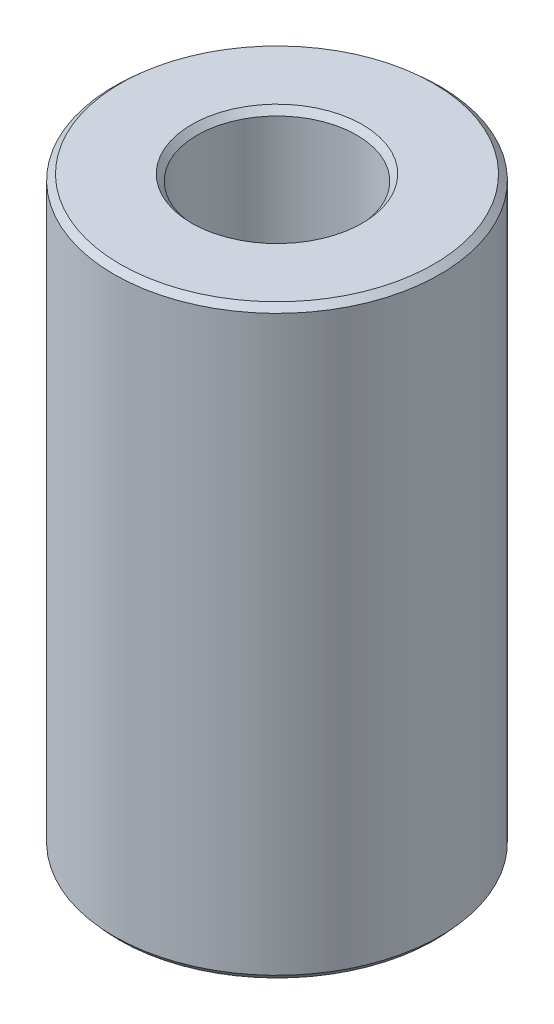
ISO-10303-21;
HEADER;
FILE_DESCRIPTION(('STEP AP214'),'2;1');
FILE_NAME('part.step','',(''),(''),'','','');
FILE_SCHEMA(('AUTOMOTIVE_DESIGN { 1 0 10303 214 1 1 1 1 }'));
ENDSEC;
DATA;
#1=APPLICATION_CONTEXT('core data for automotive mechanical design processes');
#2=APPLICATION_PROTOCOL_DEFINITION('international standard','automotive_design',2000,#1);
#3=PRODUCT_CONTEXT('',#1,'mechanical');
#4=PRODUCT('Part','Part','',(#3));
#5=PRODUCT_RELATED_PRODUCT_CATEGORY('part','',(#4));
#6=PRODUCT_DEFINITION_FORMATION('','',#4);
#7=PRODUCT_DEFINITION_CONTEXT('part definition',#1,'design');
#8=PRODUCT_DEFINITION('design','',#6,#7);
#9=PRODUCT_DEFINITION_SHAPE('','',#8);
#10=(LENGTH_UNIT() NAMED_UNIT(*) SI_UNIT(.MILLI.,.METRE.));
#11=(NAMED_UNIT(*) PLANE_ANGLE_UNIT() SI_UNIT($,.RADIAN.));
#12=(NAMED_UNIT(*) SI_UNIT($,.STERADIAN.) SOLID_ANGLE_UNIT());
#13=UNCERTAINTY_MEASURE_WITH_UNIT(LENGTH_MEASURE(1.E-05),#10,'distance_accuracy_value','');
#14=(GEOMETRIC_REPRESENTATION_CONTEXT(3) GLOBAL_UNCERTAINTY_ASSIGNED_CONTEXT((#13)) GLOBAL_UNIT_ASSIGNED_CONTEXT((#10,
#11,#12)) REPRESENTATION_CONTEXT('',''));
#15=CARTESIAN_POINT('',(0.,0.,0.));
#16=DIRECTION('',(0.,0.,1.));
#17=DIRECTION('',(1.,0.,0.));
#18=AXIS2_PLACEMENT_3D('',#15,#16,#17);
#19=CARTESIAN_POINT('',(0.,170.591020044849,0.));
#20=DIRECTION('',(0.,-1.,0.));
#21=DIRECTION('',(0.,0.,-1.));
#22=AXIS2_PLACEMENT_3D('',#19,#20,#21);
#23=CYLINDRICAL_SURFACE('',#22,47.5);
#24=CARTESIAN_POINT('',(0.,1.83181145555436,0.));
#25=DIRECTION('',(0.,1.,0.));
#26=DIRECTION('',(0.,0.,1.));
#27=AXIS2_PLACEMENT_3D('',#24,#25,#26);
#28=CIRCLE('',#27,47.5);
#29=CARTESIAN_POINT('',(0.,1.83181145555436,-47.5));
#30=VERTEX_POINT('',#29);
#31=EDGE_CURVE('E10',#30,#30,#28,.T.);
#32=CARTESIAN_POINT('',(0.,168.95492158824,0.));
#33=DIRECTION('',(0.,1.,0.));
#34=DIRECTION('',(0.,0.,1.));
#35=AXIS2_PLACEMENT_3D('',#32,#33,#34);
#36=CIRCLE('',#35,47.5);
#37=CARTESIAN_POINT('',(0.,168.95492158824,-47.5));
#38=VERTEX_POINT('',#37);
#39=EDGE_CURVE('E50',#38,#38,#36,.F.);
#40=CARTESIAN_POINT('',(0.,1.83181145555436,-47.5));
#41=CARTESIAN_POINT('',(0.,3.57267718610317,-47.5));
#42=CARTESIAN_POINT('',(0.,5.31354291665197,-47.5));
#43=CARTESIAN_POINT('',(0.,8.79527437774959,-47.5));
#44=CARTESIAN_POINT('',(0.,10.5361401082984,-47.5));
#45=CARTESIAN_POINT('',(0.,14.017871569396,-47.5));
#46=CARTESIAN_POINT('',(0.,15.7587372999448,-47.5));
#47=CARTESIAN_POINT('',(0.,19.2404687610425,-47.5));
#48=CARTESIAN_POINT('',(0.,20.9813344915913,-47.5));
#49=CARTESIAN_POINT('',(0.,24.4630659526889,-47.5));
#50=CARTESIAN_POINT('',(0.,26.2039316832377,-47.5));
#51=CARTESIAN_POINT('',(0.,29.6856631443353,-47.5));
#52=CARTESIAN_POINT('',(0.,31.4265288748841,-47.5));
#53=CARTESIAN_POINT('',(0.,34.9082603359817,-47.5));
#54=CARTESIAN_POINT('',(0.,36.6491260665305,-47.5));
#55=CARTESIAN_POINT('',(0.,40.1308575276282,-47.5));
#56=CARTESIAN_POINT('',(0.,41.871723258177,-47.5));
#57=CARTESIAN_POINT('',(0.,45.3534547192746,-47.5));
#58=CARTESIAN_POINT('',(0.,47.0943204498234,-47.5));
#59=CARTESIAN_POINT('',(0.,50.576051910921,-47.5));
#60=CARTESIAN_POINT('',(0.,52.3169176414698,-47.5));
#61=CARTESIAN_POINT('',(0.,55.7986491025674,-47.5));
#62=CARTESIAN_POINT('',(0.,57.5395148331162,-47.5));
#63=CARTESIAN_POINT('',(0.,61.0212462942138,-47.5));
#64=CARTESIAN_POINT('',(0.,62.7621120247627,-47.5));
#65=CARTESIAN_POINT('',(0.,66.2438434858603,-47.5));
#66=CARTESIAN_POINT('',(0.,67.9847092164091,-47.5));
#67=CARTESIAN_POINT('',(0.,71.4664406775067,-47.5));
#68=CARTESIAN_POINT('',(0.,73.2073064080555,-47.5));
#69=CARTESIAN_POINT('',(0.,76.6890378691531,-47.5));
#70=CARTESIAN_POINT('',(0.,78.4299035997019,-47.5));
#71=CARTESIAN_POINT('',(0.,81.9116350607996,-47.5));
#72=CARTESIAN_POINT('',(0.,83.6525007913484,-47.5));
#73=CARTESIAN_POINT('',(0.,87.134232252446,-47.5));
#74=CARTESIAN_POINT('',(0.,88.8750979829948,-47.5));
#75=CARTESIAN_POINT('',(0.,92.3568294440924,-47.5));
#76=CARTESIAN_POINT('',(0.,94.0976951746412,-47.5));
#77=CARTESIAN_POINT('',(0.,97.5794266357388,-47.5));
#78=CARTESIAN_POINT('',(0.,99.3202923662876,-47.5));
#79=CARTESIAN_POINT('',(0.,102.802023827385,-47.5));
#80=CARTESIAN_POINT('',(0.,104.542889557934,-47.5));
#81=CARTESIAN_POINT('',(0.,108.024621019032,-47.5));
#82=CARTESIAN_POINT('',(0.,109.76548674958,-47.5));
#83=CARTESIAN_POINT('',(0.,113.247218210678,-47.5));
#84=CARTESIAN_POINT('',(0.,114.988083941227,-47.5));
#85=CARTESIAN_POINT('',(0.,118.469815402325,-47.5));
#86=CARTESIAN_POINT('',(0.,120.210681132873,-47.5));
#87=CARTESIAN_POINT('',(0.,123.692412593971,-47.5));
#88=CARTESIAN_POINT('',(0.,125.43327832452,-47.5));
#89=CARTESIAN_POINT('',(0.,128.915009785617,-47.5));
#90=CARTESIAN_POINT('',(0.,130.655875516166,-47.5));
#91=CARTESIAN_POINT('',(0.,134.137606977264,-47.5));
#92=CARTESIAN_POINT('',(0.,135.878472707813,-47.5));
#93=CARTESIAN_POINT('',(0.,139.36020416891,-47.5));
#94=CARTESIAN_POINT('',(0.,141.101069899459,-47.5));
#95=CARTESIAN_POINT('',(0.,144.582801360557,-47.5));
#96=CARTESIAN_POINT('',(0.,146.323667091105,-47.5));
#97=CARTESIAN_POINT('',(0.,149.805398552203,-47.5));
#98=CARTESIAN_POINT('',(0.,151.546264282752,-47.5));
#99=CARTESIAN_POINT('',(0.,155.02799574385,-47.5));
#100=CARTESIAN_POINT('',(0.,156.768861474398,-47.5));
#101=CARTESIAN_POINT('',(0.,160.250592935496,-47.5));
#102=CARTESIAN_POINT('',(0.,161.991458666045,-47.5));
#103=CARTESIAN_POINT('',(0.,165.473190127142,-47.5));
#104=CARTESIAN_POINT('',(0.,167.214055857691,-47.5));
#105=CARTESIAN_POINT('',(0.,168.95492158824,-47.5));
#106=B_SPLINE_CURVE_WITH_KNOTS('',3,(#40,#41,#42,#43,#44,#45,#46,#47,#48,#49,#50,#51,#52,#53,
#54,#55,#56,#57,#58,#59,#60,#61,#62,#63,#64,#65,#66,#67,#68,#69,#70,#71,#72,#73,#74,#75,#76,#77,
#78,#79,#80,#81,#82,#83,#84,#85,#86,#87,#88,#89,#90,#91,#92,#93,#94,#95,#96,#97,#98,#99,#100,
#101,#102,#103,#104,#105),.UNSPECIFIED.,.F.,.F.,(4,2,2,2,2,2,2,2,2,2,2,2,2,2,2,2,2,2,2,2,2,2,2,
2,2,2,2,2,2,2,2,2,4),(0.,5.22259719164642,10.4451943832929,15.6677915749393,20.8903887665857,
26.1129859582321,31.3355831498786,36.558180341525,41.7807775331714,47.0033747248178,
52.2259719164643,57.4485691081107,62.6711662997571,67.8937634914035,73.11636068305,
78.3389578746964,83.5615550663428,88.7841522579892,94.0067494496357,99.2293466412821,
104.451943832929,109.674541024575,114.897138216221,120.119735407868,125.342332599514,
130.564929791161,135.787526982807,141.010124174453,146.2327213661,151.455318557746,
156.677915749393,161.900512941039,167.123110132686),.UNSPECIFIED.);
#107=EDGE_CURVE('BSEAM39',#30,#38,#106,.T.);
#108=ORIENTED_EDGE('',*,*,#31,.T.);
#109=ORIENTED_EDGE('',*,*,#39,.T.);
#110=ORIENTED_EDGE('',*,*,#107,.T.);
#111=ORIENTED_EDGE('',*,*,#107,.F.);
#112=EDGE_LOOP('',(#108,#110,#109,#111));
#113=FACE_BOUND('',#112,.T.);
#114=ADVANCED_FACE('F39',(#113),#23,.T.);
#115=CARTESIAN_POINT('',(0.,170.591020044849,0.));
#116=DIRECTION('',(0.,1.,0.));
#117=DIRECTION('',(0.,0.,1.));
#118=AXIS2_PLACEMENT_3D('',#115,#116,#117);
#119=PLANE('',#118);
#120=CARTESIAN_POINT('',(0.,170.591020044849,0.));
#121=DIRECTION('',(0.,1.,0.));
#122=DIRECTION('',(0.,0.,1.));
#123=AXIS2_PLACEMENT_3D('',#120,#121,#122);
#124=CIRCLE('',#123,24.8987083343246);
#125=CARTESIAN_POINT('',(0.,170.591020044849,24.8987083343246));
#126=VERTEX_POINT('',#125);
#127=EDGE_CURVE('E58',#126,#126,#124,.F.);
#128=ORIENTED_EDGE('',*,*,#127,.T.);
#129=EDGE_LOOP('',(#128));
#130=FACE_BOUND('',#129,.T.);
#131=CARTESIAN_POINT('',(0.,170.591020044849,0.));
#132=DIRECTION('',(0.,1.,0.));
#133=DIRECTION('',(0.,0.,1.));
#134=AXIS2_PLACEMENT_3D('',#131,#132,#133);
#135=CIRCLE('',#134,45.6681885444459);
#136=CARTESIAN_POINT('',(0.,170.591020044849,45.6681885444459));
#137=VERTEX_POINT('',#136);
#138=EDGE_CURVE('E61',#137,#137,#135,.T.);
#139=ORIENTED_EDGE('',*,*,#138,.T.);
#140=EDGE_LOOP('',(#139));
#141=FACE_BOUND('',#140,.T.);
#142=ADVANCED_FACE('F88',(#130,#141),#119,.T.);
#143=CARTESIAN_POINT('',(0.,0.,0.));
#144=DIRECTION('',(0.,1.,0.));
#145=DIRECTION('',(0.,0.,1.));
#146=AXIS2_PLACEMENT_3D('',#143,#144,#145);
#147=PLANE('',#146);
#148=CARTESIAN_POINT('',(0.,0.,0.));
#149=DIRECTION('',(0.,1.,0.));
#150=DIRECTION('',(0.,0.,1.));
#151=AXIS2_PLACEMENT_3D('',#148,#149,#150);
#152=CIRCLE('',#151,25.09442133327);
#153=CARTESIAN_POINT('',(0.,0.,25.09442133327));
#154=VERTEX_POINT('',#153);
#155=EDGE_CURVE('E51',#154,#154,#152,.T.);
#156=ORIENTED_EDGE('',*,*,#155,.T.);
#157=EDGE_LOOP('',(#156));
#158=FACE_BOUND('',#157,.T.);
#159=CARTESIAN_POINT('',(0.,0.,0.));
#160=DIRECTION('',(0.,1.,0.));
#161=DIRECTION('',(0.,0.,1.));
#162=AXIS2_PLACEMENT_3D('',#159,#160,#161);
#163=CIRCLE('',#162,45.8639015433911);
#164=CARTESIAN_POINT('',(0.,0.,45.8639015433911));
#165=VERTEX_POINT('',#164);
#166=EDGE_CURVE('E54',#165,#165,#163,.F.);
#167=ORIENTED_EDGE('',*,*,#166,.T.);
#168=EDGE_LOOP('',(#167));
#169=FACE_BOUND('',#168,.T.);
#170=ADVANCED_FACE('F83',(#158,#169),#147,.F.);
#171=CARTESIAN_POINT('',(0.,170.591020044849,0.));
#172=DIRECTION('',(0.,-1.,0.));
#173=DIRECTION('',(0.,0.,-1.));
#174=AXIS2_PLACEMENT_3D('',#171,#172,#173);
#175=CYLINDRICAL_SURFACE('',#174,23.2626098777159);
#176=CARTESIAN_POINT('',(0.,168.759208589294,0.));
#177=DIRECTION('',(0.,1.,0.));
#178=DIRECTION('',(0.,0.,1.));
#179=AXIS2_PLACEMENT_3D('',#176,#177,#178);
#180=CIRCLE('',#179,23.2626098777159);
#181=CARTESIAN_POINT('',(0.,168.759208589294,-23.2626098777159));
#182=VERTEX_POINT('',#181);
#183=EDGE_CURVE('E67',#182,#182,#180,.T.);
#184=CARTESIAN_POINT('',(0.,1.63609845660864,0.));
#185=DIRECTION('',(0.,1.,0.));
#186=DIRECTION('',(0.,0.,1.));
#187=AXIS2_PLACEMENT_3D('',#184,#185,#186);
#188=CIRCLE('',#187,23.2626098777159);
#189=CARTESIAN_POINT('',(0.,1.63609845660864,-23.2626098777159));
#190=VERTEX_POINT('',#189);
#191=EDGE_CURVE('E69',#190,#190,#188,.F.);
#192=CARTESIAN_POINT('',(0.,168.759208589294,-23.2626098777159));
#193=CARTESIAN_POINT('',(0.,167.018342858746,-23.2626098777159));
#194=CARTESIAN_POINT('',(0.,165.277477128197,-23.2626098777159));
#195=CARTESIAN_POINT('',(0.,161.795745667099,-23.2626098777159));
#196=CARTESIAN_POINT('',(0.,160.05487993655,-23.2626098777159));
#197=CARTESIAN_POINT('',(0.,156.573148475453,-23.2626098777159));
#198=CARTESIAN_POINT('',(0.,154.832282744904,-23.2626098777159));
#199=CARTESIAN_POINT('',(0.,151.350551283806,-23.2626098777159));
#200=CARTESIAN_POINT('',(0.,149.609685553257,-23.2626098777159));
#201=CARTESIAN_POINT('',(0.,146.12795409216,-23.2626098777159));
#202=CARTESIAN_POINT('',(0.,144.387088361611,-23.2626098777159));
#203=CARTESIAN_POINT('',(0.,140.905356900513,-23.2626098777159));
#204=CARTESIAN_POINT('',(0.,139.164491169965,-23.2626098777159));
#205=CARTESIAN_POINT('',(0.,135.682759708867,-23.2626098777159));
#206=CARTESIAN_POINT('',(0.,133.941893978318,-23.2626098777159));
#207=CARTESIAN_POINT('',(0.,130.460162517221,-23.2626098777159));
#208=CARTESIAN_POINT('',(0.,128.719296786672,-23.2626098777159));
#209=CARTESIAN_POINT('',(0.,125.237565325574,-23.2626098777159));
#210=CARTESIAN_POINT('',(0.,123.496699595025,-23.2626098777159));
#211=CARTESIAN_POINT('',(0.,120.014968133928,-23.2626098777159));
#212=CARTESIAN_POINT('',(0.,118.274102403379,-23.2626098777159));
#213=CARTESIAN_POINT('',(0.,114.792370942281,-23.2626098777159));
#214=CARTESIAN_POINT('',(0.,113.051505211732,-23.2626098777159));
#215=CARTESIAN_POINT('',(0.,109.569773750635,-23.2626098777159));
#216=CARTESIAN_POINT('',(0.,107.828908020086,-23.2626098777159));
#217=CARTESIAN_POINT('',(0.,104.347176558988,-23.2626098777159));
#218=CARTESIAN_POINT('',(0.,102.60631082844,-23.2626098777159));
#219=CARTESIAN_POINT('',(0.,99.124579367342,-23.2626098777159));
#220=CARTESIAN_POINT('',(0.,97.3837136367932,-23.2626098777159));
#221=CARTESIAN_POINT('',(0.,93.9019821756956,-23.2626098777159));
#222=CARTESIAN_POINT('',(0.,92.1611164451468,-23.2626098777159));
#223=CARTESIAN_POINT('',(0.,88.6793849840492,-23.2626098777159));
#224=CARTESIAN_POINT('',(0.,86.9385192535003,-23.2626098777159));
#225=CARTESIAN_POINT('',(0.,83.4567877924027,-23.2626098777159));
#226=CARTESIAN_POINT('',(0.,81.7159220618539,-23.2626098777159));
#227=CARTESIAN_POINT('',(0.,78.2341906007563,-23.2626098777159));
#228=CARTESIAN_POINT('',(0.,76.4933248702075,-23.2626098777159));
#229=CARTESIAN_POINT('',(0.,73.0115934091099,-23.2626098777159));
#230=CARTESIAN_POINT('',(0.,71.270727678561,-23.2626098777159));
#231=CARTESIAN_POINT('',(0.,67.7889962174634,-23.2626098777159));
#232=CARTESIAN_POINT('',(0.,66.0481304869146,-23.2626098777159));
#233=CARTESIAN_POINT('',(0.,62.566399025817,-23.2626098777159));
#234=CARTESIAN_POINT('',(0.,60.8255332952682,-23.2626098777159));
#235=CARTESIAN_POINT('',(0.,57.3438018341706,-23.2626098777159));
#236=CARTESIAN_POINT('',(0.,55.6029361036218,-23.2626098777159));
#237=CARTESIAN_POINT('',(0.,52.1212046425241,-23.2626098777159));
#238=CARTESIAN_POINT('',(0.,50.3803389119753,-23.2626098777159));
#239=CARTESIAN_POINT('',(0.,46.8986074508777,-23.2626098777159));
#240=CARTESIAN_POINT('',(0.,45.1577417203289,-23.2626098777159));
#241=CARTESIAN_POINT('',(0.,41.6760102592313,-23.2626098777159));
#242=CARTESIAN_POINT('',(0.,39.9351445286825,-23.2626098777159));
#243=CARTESIAN_POINT('',(0.,36.4534130675849,-23.2626098777159));
#244=CARTESIAN_POINT('',(0.,34.7125473370361,-23.2626098777159));
#245=CARTESIAN_POINT('',(0.,31.2308158759384,-23.2626098777159));
#246=CARTESIAN_POINT('',(0.,29.4899501453896,-23.2626098777159));
#247=CARTESIAN_POINT('',(0.,26.008218684292,-23.2626098777159));
#248=CARTESIAN_POINT('',(0.,24.2673529537432,-23.2626098777159));
#249=CARTESIAN_POINT('',(0.,20.7856214926456,-23.2626098777159));
#250=CARTESIAN_POINT('',(0.,19.0447557620968,-23.2626098777159));
#251=CARTESIAN_POINT('',(0.,15.5630243009991,-23.2626098777159));
#252=CARTESIAN_POINT('',(0.,13.8221585704503,-23.2626098777159));
#253=CARTESIAN_POINT('',(0.,10.3404271093527,-23.2626098777159));
#254=CARTESIAN_POINT('',(0.,8.59956137880388,-23.2626098777159));
#255=CARTESIAN_POINT('',(0.,5.11782991770625,-23.2626098777159));
#256=CARTESIAN_POINT('',(0.,3.37696418715745,-23.2626098777159));
#257=CARTESIAN_POINT('',(0.,1.63609845660864,-23.2626098777159));
#258=B_SPLINE_CURVE_WITH_KNOTS('',3,(#192,#193,#194,#195,#196,#197,#198,#199,#200,#201,#202,
#203,#204,#205,#206,#207,#208,#209,#210,#211,#212,#213,#214,#215,#216,#217,#218,#219,#220,#221,
#222,#223,#224,#225,#226,#227,#228,#229,#230,#231,#232,#233,#234,#235,#236,#237,#238,#239,#240,
#241,#242,#243,#244,#245,#246,#247,#248,#249,#250,#251,#252,#253,#254,#255,#256,#257),
.UNSPECIFIED.,.F.,.F.,(4,2,2,2,2,2,2,2,2,2,2,2,2,2,2,2,2,2,2,2,2,2,2,2,2,2,2,2,2,2,2,2,4),(0.,
5.22259719164644,10.4451943832929,15.6677915749393,20.8903887665857,26.1129859582322,
31.3355831498786,36.558180341525,41.7807775331714,47.0033747248179,52.2259719164643,
57.4485691081107,62.6711662997572,67.8937634914036,73.11636068305,78.3389578746965,
83.5615550663429,88.7841522579893,94.0067494496357,99.2293466412822,104.451943832929,
109.674541024575,114.897138216221,120.119735407868,125.342332599514,130.564929791161,
135.787526982807,141.010124174454,146.2327213661,151.455318557746,156.677915749393,
161.900512941039,167.123110132686),.UNSPECIFIED.);
#259=EDGE_CURVE('BSEAM71',#182,#190,#258,.T.);
#260=ORIENTED_EDGE('',*,*,#183,.T.);
#261=ORIENTED_EDGE('',*,*,#191,.T.);
#262=ORIENTED_EDGE('',*,*,#259,.T.);
#263=ORIENTED_EDGE('',*,*,#259,.F.);
#264=EDGE_LOOP('',(#260,#262,#261,#263));
#265=FACE_BOUND('',#264,.T.);
#266=ADVANCED_FACE('F71',(#265),#175,.F.);
#267=CARTESIAN_POINT('',(0.,168.759208589294,0.));
#268=DIRECTION('',(0.,1.,0.));
#269=DIRECTION('',(0.,0.,1.));
#270=AXIS2_PLACEMENT_3D('',#267,#268,#269);
#271=CONICAL_SURFACE('',#270,23.2626098777159,0.729022530575232);
#272=ORIENTED_EDGE('',*,*,#127,.F.);
#273=EDGE_LOOP('',(#272));
#274=FACE_BOUND('',#273,.T.);
#275=ORIENTED_EDGE('',*,*,#183,.F.);
#276=EDGE_LOOP('',(#275));
#277=FACE_BOUND('',#276,.T.);
#278=ADVANCED_FACE('F77',(#274,#277),#271,.F.);
#279=CARTESIAN_POINT('',(0.,0.,0.));
#280=DIRECTION('',(0.,-1.,0.));
#281=DIRECTION('',(0.,0.,-1.));
#282=AXIS2_PLACEMENT_3D('',#279,#280,#281);
#283=CONICAL_SURFACE('',#282,25.09442133327,0.841773796219659);
#284=ORIENTED_EDGE('',*,*,#191,.F.);
#285=EDGE_LOOP('',(#284));
#286=FACE_BOUND('',#285,.T.);
#287=ORIENTED_EDGE('',*,*,#155,.F.);
#288=EDGE_LOOP('',(#287));
#289=FACE_BOUND('',#288,.T.);
#290=ADVANCED_FACE('F73',(#286,#289),#283,.F.);
#291=CARTESIAN_POINT('',(0.,1.83181145555433,0.));
#292=DIRECTION('',(0.,1.,0.));
#293=DIRECTION('',(0.,0.,1.));
#294=AXIS2_PLACEMENT_3D('',#291,#292,#293);
#295=CONICAL_SURFACE('',#294,47.5,0.729022530575244);
#296=ORIENTED_EDGE('',*,*,#166,.F.);
#297=EDGE_LOOP('',(#296));
#298=FACE_BOUND('',#297,.T.);
#299=ORIENTED_EDGE('',*,*,#31,.F.);
#300=EDGE_LOOP('',(#299));
#301=FACE_BOUND('',#300,.T.);
#302=ADVANCED_FACE('F76',(#298,#301),#295,.T.);
#303=CARTESIAN_POINT('',(0.,170.591020044849,0.));
#304=DIRECTION('',(0.,-1.,0.));
#305=DIRECTION('',(0.,0.,-1.));
#306=AXIS2_PLACEMENT_3D('',#303,#304,#305);
#307=CONICAL_SURFACE('',#306,45.6681885444459,0.841773796219657);
#308=ORIENTED_EDGE('',*,*,#39,.F.);
#309=EDGE_LOOP('',(#308));
#310=FACE_BOUND('',#309,.T.);
#311=ORIENTED_EDGE('',*,*,#138,.F.);
#312=EDGE_LOOP('',(#311));
#313=FACE_BOUND('',#312,.T.);
#314=ADVANCED_FACE('F45',(#310,#313),#307,.T.);
#315=CLOSED_SHELL('',(#114,#142,#170,#266,#278,#290,#302,#314));
#316=MANIFOLD_SOLID_BREP('B2',#315);
#317=ADVANCED_BREP_SHAPE_REPRESENTATION('',(#18,#316),#14);
#318=SHAPE_DEFINITION_REPRESENTATION(#9,#317);
ENDSEC;
END-ISO-10303-21;
